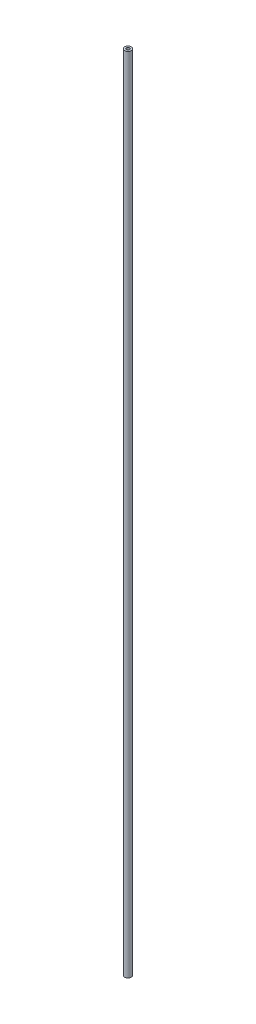
ISO-10303-21;
HEADER;
FILE_DESCRIPTION(('STEP AP214'),'2;1');
FILE_NAME('part.step','',(''),(''),'','','');
FILE_SCHEMA(('AUTOMOTIVE_DESIGN { 1 0 10303 214 1 1 1 1 }'));
ENDSEC;
DATA;
#1=APPLICATION_CONTEXT('core data for automotive mechanical design processes');
#2=APPLICATION_PROTOCOL_DEFINITION('international standard','automotive_design',2000,#1);
#3=PRODUCT_CONTEXT('',#1,'mechanical');
#4=PRODUCT('Part','Part','',(#3));
#5=PRODUCT_RELATED_PRODUCT_CATEGORY('part','',(#4));
#6=PRODUCT_DEFINITION_FORMATION('','',#4);
#7=PRODUCT_DEFINITION_CONTEXT('part definition',#1,'design');
#8=PRODUCT_DEFINITION('design','',#6,#7);
#9=PRODUCT_DEFINITION_SHAPE('','',#8);
#10=(LENGTH_UNIT() NAMED_UNIT(*) SI_UNIT(.MILLI.,.METRE.));
#11=(NAMED_UNIT(*) PLANE_ANGLE_UNIT() SI_UNIT($,.RADIAN.));
#12=(NAMED_UNIT(*) SI_UNIT($,.STERADIAN.) SOLID_ANGLE_UNIT());
#13=UNCERTAINTY_MEASURE_WITH_UNIT(LENGTH_MEASURE(1.E-05),#10,'distance_accuracy_value','');
#14=(GEOMETRIC_REPRESENTATION_CONTEXT(3) GLOBAL_UNCERTAINTY_ASSIGNED_CONTEXT((#13)) GLOBAL_UNIT_ASSIGNED_CONTEXT((#10,
#11,#12)) REPRESENTATION_CONTEXT('',''));
#15=CARTESIAN_POINT('',(0.,0.,0.));
#16=DIRECTION('',(0.,0.,1.));
#17=DIRECTION('',(1.,0.,0.));
#18=AXIS2_PLACEMENT_3D('',#15,#16,#17);
#19=CARTESIAN_POINT('',(0.,-120.,0.));
#20=DIRECTION('',(0.,1.,0.));
#21=DIRECTION('',(0.,0.,1.));
#22=AXIS2_PLACEMENT_3D('',#19,#20,#21);
#23=CYLINDRICAL_SURFACE('',#22,1.);
#24=CARTESIAN_POINT('',(0.,-120.,0.));
#25=DIRECTION('',(0.,1.,0.));
#26=DIRECTION('',(0.,0.,1.));
#27=AXIS2_PLACEMENT_3D('',#24,#25,#26);
#28=CIRCLE('',#27,1.);
#29=CARTESIAN_POINT('',(0.,-120.,1.));
#30=VERTEX_POINT('',#29);
#31=EDGE_CURVE('E10',#30,#30,#28,.T.);
#32=ORIENTED_EDGE('',*,*,#31,.T.);
#33=EDGE_LOOP('',(#32));
#34=FACE_BOUND('',#33,.T.);
#35=CARTESIAN_POINT('',(0.,120.,0.));
#36=DIRECTION('',(0.,1.,0.));
#37=DIRECTION('',(0.,0.,1.));
#38=AXIS2_PLACEMENT_3D('',#35,#36,#37);
#39=CIRCLE('',#38,1.);
#40=CARTESIAN_POINT('',(0.,120.,1.));
#41=VERTEX_POINT('',#40);
#42=EDGE_CURVE('E47',#41,#41,#39,.T.);
#43=ORIENTED_EDGE('',*,*,#42,.F.);
#44=EDGE_LOOP('',(#43));
#45=FACE_BOUND('',#44,.T.);
#46=ADVANCED_FACE('F37',(#34,#45),#23,.T.);
#47=CARTESIAN_POINT('',(0.,-120.,0.));
#48=DIRECTION('',(0.,1.,0.));
#49=DIRECTION('',(0.,0.,1.));
#50=AXIS2_PLACEMENT_3D('',#47,#48,#49);
#51=PLANE('',#50);
#52=CARTESIAN_POINT('',(0.,-120.,0.));
#53=DIRECTION('',(0.,1.,0.));
#54=DIRECTION('',(0.,0.,1.));
#55=AXIS2_PLACEMENT_3D('',#52,#53,#54);
#56=CIRCLE('',#55,0.5);
#57=CARTESIAN_POINT('',(0.,-120.,0.5));
#58=VERTEX_POINT('',#57);
#59=EDGE_CURVE('E43',#58,#58,#56,.T.);
#60=ORIENTED_EDGE('',*,*,#59,.T.);
#61=EDGE_LOOP('',(#60));
#62=FACE_BOUND('',#61,.T.);
#63=ORIENTED_EDGE('',*,*,#31,.F.);
#64=EDGE_LOOP('',(#63));
#65=FACE_BOUND('',#64,.T.);
#66=ADVANCED_FACE('F66',(#62,#65),#51,.F.);
#67=CARTESIAN_POINT('',(0.,-120.,0.));
#68=DIRECTION('',(0.,1.,0.));
#69=DIRECTION('',(0.,0.,1.));
#70=AXIS2_PLACEMENT_3D('',#67,#68,#69);
#71=CYLINDRICAL_SURFACE('',#70,0.5);
#72=ORIENTED_EDGE('',*,*,#59,.F.);
#73=EDGE_LOOP('',(#72));
#74=FACE_BOUND('',#73,.T.);
#75=CARTESIAN_POINT('',(0.,120.,0.));
#76=DIRECTION('',(0.,1.,0.));
#77=DIRECTION('',(0.,0.,1.));
#78=AXIS2_PLACEMENT_3D('',#75,#76,#77);
#79=CIRCLE('',#78,0.5);
#80=CARTESIAN_POINT('',(0.,120.,0.5));
#81=VERTEX_POINT('',#80);
#82=EDGE_CURVE('E51',#81,#81,#79,.T.);
#83=ORIENTED_EDGE('',*,*,#82,.T.);
#84=EDGE_LOOP('',(#83));
#85=FACE_BOUND('',#84,.T.);
#86=ADVANCED_FACE('F57',(#74,#85),#71,.F.);
#87=CARTESIAN_POINT('',(0.,120.,0.));
#88=DIRECTION('',(0.,1.,0.));
#89=DIRECTION('',(0.,0.,1.));
#90=AXIS2_PLACEMENT_3D('',#87,#88,#89);
#91=PLANE('',#90);
#92=ORIENTED_EDGE('',*,*,#42,.T.);
#93=EDGE_LOOP('',(#92));
#94=FACE_BOUND('',#93,.T.);
#95=ORIENTED_EDGE('',*,*,#82,.F.);
#96=EDGE_LOOP('',(#95));
#97=FACE_BOUND('',#96,.T.);
#98=ADVANCED_FACE('F59',(#94,#97),#91,.T.);
#99=CLOSED_SHELL('',(#46,#66,#86,#98));
#100=MANIFOLD_SOLID_BREP('B2',#99);
#101=ADVANCED_BREP_SHAPE_REPRESENTATION('',(#18,#100),#14);
#102=SHAPE_DEFINITION_REPRESENTATION(#9,#101);
ENDSEC;
END-ISO-10303-21;
